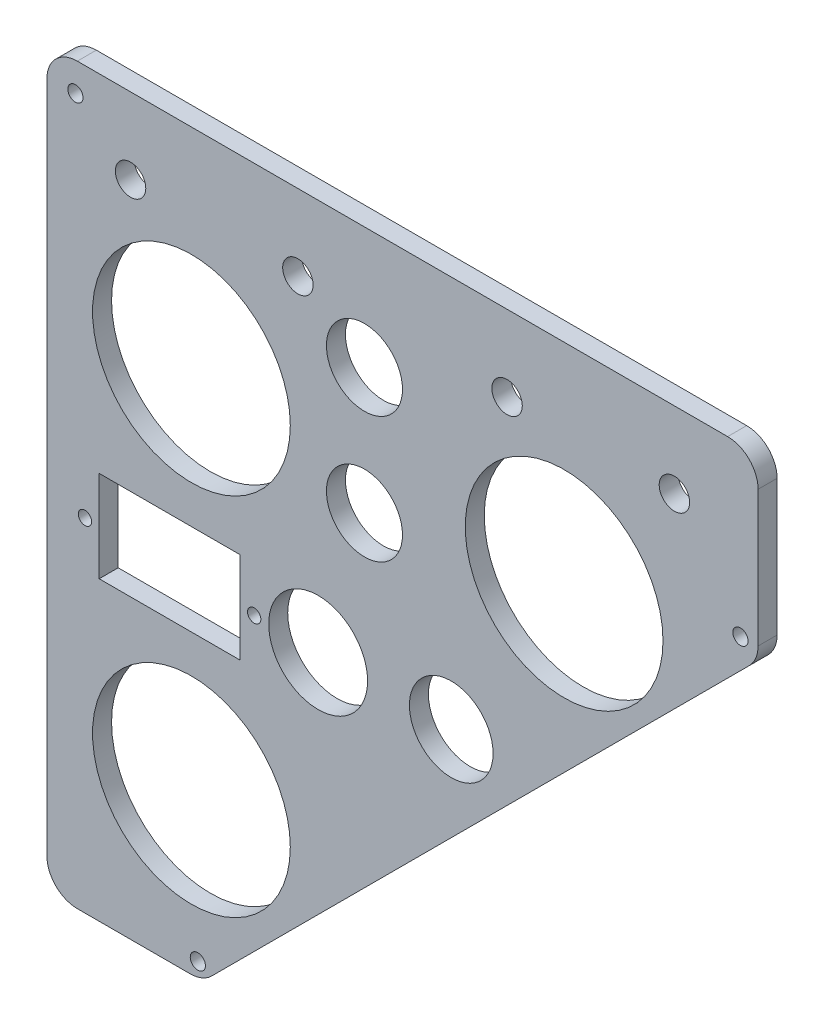
ISO-10303-21;
HEADER;
FILE_DESCRIPTION(('STEP AP214'),'2;1');
FILE_NAME('part.step','',(''),(''),'','','');
FILE_SCHEMA(('AUTOMOTIVE_DESIGN { 1 0 10303 214 1 1 1 1 }'));
ENDSEC;
DATA;
#1=APPLICATION_CONTEXT('core data for automotive mechanical design processes');
#2=APPLICATION_PROTOCOL_DEFINITION('international standard','automotive_design',2000,#1);
#3=PRODUCT_CONTEXT('',#1,'mechanical');
#4=PRODUCT('Part','Part','',(#3));
#5=PRODUCT_RELATED_PRODUCT_CATEGORY('part','',(#4));
#6=PRODUCT_DEFINITION_FORMATION('','',#4);
#7=PRODUCT_DEFINITION_CONTEXT('part definition',#1,'design');
#8=PRODUCT_DEFINITION('design','',#6,#7);
#9=PRODUCT_DEFINITION_SHAPE('','',#8);
#10=(LENGTH_UNIT() NAMED_UNIT(*) SI_UNIT(.MILLI.,.METRE.));
#11=(NAMED_UNIT(*) PLANE_ANGLE_UNIT() SI_UNIT($,.RADIAN.));
#12=(NAMED_UNIT(*) SI_UNIT($,.STERADIAN.) SOLID_ANGLE_UNIT());
#13=UNCERTAINTY_MEASURE_WITH_UNIT(LENGTH_MEASURE(1.E-05),#10,'distance_accuracy_value','');
#14=(GEOMETRIC_REPRESENTATION_CONTEXT(3) GLOBAL_UNCERTAINTY_ASSIGNED_CONTEXT((#13)) GLOBAL_UNIT_ASSIGNED_CONTEXT((#10,
#11,#12)) REPRESENTATION_CONTEXT('',''));
#15=CARTESIAN_POINT('',(0.,0.,0.));
#16=DIRECTION('',(0.,0.,1.));
#17=DIRECTION('',(1.,0.,0.));
#18=AXIS2_PLACEMENT_3D('',#15,#16,#17);
#19=CARTESIAN_POINT('',(8.,185.,5.));
#20=DIRECTION('',(0.,0.,-1.));
#21=DIRECTION('',(-1.,0.,0.));
#22=AXIS2_PLACEMENT_3D('',#19,#20,#21);
#23=CYLINDRICAL_SURFACE('',#22,8.);
#24=CARTESIAN_POINT('',(8.,185.,0.));
#25=DIRECTION('',(0.,0.,1.));
#26=DIRECTION('',(-1.,0.,0.));
#27=AXIS2_PLACEMENT_3D('',#24,#25,#26);
#28=CIRCLE('',#27,8.);
#29=CARTESIAN_POINT('',(8.,193.,0.));
#30=VERTEX_POINT('',#29);
#31=CARTESIAN_POINT('',(0.,185.,0.));
#32=VERTEX_POINT('',#31);
#33=EDGE_CURVE('E189',#30,#32,#28,.T.);
#34=ORIENTED_EDGE('',*,*,#33,.T.);
#35=DIRECTION('',(0.,0.,-1.));
#36=VECTOR('',#35,1.);
#37=CARTESIAN_POINT('',(0.,185.,5.));
#38=LINE('',#37,#36);
#39=CARTESIAN_POINT('',(0.,185.,5.));
#40=VERTEX_POINT('',#39);
#41=EDGE_CURVE('E236',#40,#32,#38,.T.);
#42=ORIENTED_EDGE('',*,*,#41,.F.);
#43=CARTESIAN_POINT('',(8.,185.,5.));
#44=DIRECTION('',(0.,0.,1.));
#45=DIRECTION('',(-1.,0.,0.));
#46=AXIS2_PLACEMENT_3D('',#43,#44,#45);
#47=CIRCLE('',#46,8.);
#48=CARTESIAN_POINT('',(8.,193.,5.));
#49=VERTEX_POINT('',#48);
#50=EDGE_CURVE('E166',#49,#40,#47,.T.);
#51=ORIENTED_EDGE('',*,*,#50,.F.);
#52=DIRECTION('',(0.,0.,-1.));
#53=VECTOR('',#52,1.);
#54=CARTESIAN_POINT('',(8.,193.,5.));
#55=LINE('',#54,#53);
#56=EDGE_CURVE('E188',#49,#30,#55,.T.);
#57=ORIENTED_EDGE('',*,*,#56,.T.);
#58=EDGE_LOOP('',(#34,#42,#51,#57));
#59=FACE_BOUND('',#58,.T.);
#60=ADVANCED_FACE('F36',(#59),#23,.T.);
#61=CARTESIAN_POINT('',(0.,8.,5.));
#62=DIRECTION('',(1.,0.,0.));
#63=DIRECTION('',(0.,1.,0.));
#64=AXIS2_PLACEMENT_3D('',#61,#62,#63);
#65=PLANE('',#64);
#66=DIRECTION('',(0.,-1.,0.));
#67=VECTOR('',#66,1.);
#68=CARTESIAN_POINT('',(0.,8.,0.));
#69=LINE('',#68,#67);
#70=CARTESIAN_POINT('',(0.,8.,0.));
#71=VERTEX_POINT('',#70);
#72=EDGE_CURVE('E192',#32,#71,#69,.T.);
#73=ORIENTED_EDGE('',*,*,#72,.T.);
#74=DIRECTION('',(0.,0.,-1.));
#75=VECTOR('',#74,1.);
#76=CARTESIAN_POINT('',(0.,8.,5.));
#77=LINE('',#76,#75);
#78=CARTESIAN_POINT('',(0.,8.,5.));
#79=VERTEX_POINT('',#78);
#80=EDGE_CURVE('E233',#79,#71,#77,.T.);
#81=ORIENTED_EDGE('',*,*,#80,.F.);
#82=DIRECTION('',(0.,-1.,0.));
#83=VECTOR('',#82,1.);
#84=CARTESIAN_POINT('',(0.,8.,5.));
#85=LINE('',#84,#83);
#86=EDGE_CURVE('E169',#40,#79,#85,.T.);
#87=ORIENTED_EDGE('',*,*,#86,.F.);
#88=ORIENTED_EDGE('',*,*,#41,.T.);
#89=EDGE_LOOP('',(#73,#81,#87,#88));
#90=FACE_BOUND('',#89,.T.);
#91=ADVANCED_FACE('F374',(#90),#65,.F.);
#92=CARTESIAN_POINT('',(8.,8.,5.));
#93=DIRECTION('',(0.,0.,-1.));
#94=DIRECTION('',(-1.,0.,0.));
#95=AXIS2_PLACEMENT_3D('',#92,#93,#94);
#96=CYLINDRICAL_SURFACE('',#95,8.);
#97=CARTESIAN_POINT('',(8.,8.,0.));
#98=DIRECTION('',(0.,0.,1.));
#99=DIRECTION('',(1.,0.,0.));
#100=AXIS2_PLACEMENT_3D('',#97,#98,#99);
#101=CIRCLE('',#100,8.);
#102=CARTESIAN_POINT('',(8.,0.,0.));
#103=VERTEX_POINT('',#102);
#104=EDGE_CURVE('E195',#71,#103,#101,.T.);
#105=ORIENTED_EDGE('',*,*,#104,.T.);
#106=DIRECTION('',(0.,0.,-1.));
#107=VECTOR('',#106,1.);
#108=CARTESIAN_POINT('',(8.,0.,5.));
#109=LINE('',#108,#107);
#110=CARTESIAN_POINT('',(8.,0.,5.));
#111=VERTEX_POINT('',#110);
#112=EDGE_CURVE('E230',#111,#103,#109,.T.);
#113=ORIENTED_EDGE('',*,*,#112,.F.);
#114=CARTESIAN_POINT('',(8.,8.,5.));
#115=DIRECTION('',(0.,0.,1.));
#116=DIRECTION('',(1.,0.,0.));
#117=AXIS2_PLACEMENT_3D('',#114,#115,#116);
#118=CIRCLE('',#117,8.);
#119=EDGE_CURVE('E172',#79,#111,#118,.T.);
#120=ORIENTED_EDGE('',*,*,#119,.F.);
#121=ORIENTED_EDGE('',*,*,#80,.T.);
#122=EDGE_LOOP('',(#105,#113,#120,#121));
#123=FACE_BOUND('',#122,.T.);
#124=ADVANCED_FACE('F379',(#123),#96,.T.);
#125=CARTESIAN_POINT('',(37.6862915010168,0.,5.));
#126=DIRECTION('',(0.,1.,0.));
#127=DIRECTION('',(-1.,0.,0.));
#128=AXIS2_PLACEMENT_3D('',#125,#126,#127);
#129=PLANE('',#128);
#130=DIRECTION('',(1.,0.,0.));
#131=VECTOR('',#130,1.);
#132=CARTESIAN_POINT('',(37.6862915010168,0.,0.));
#133=LINE('',#132,#131);
#134=CARTESIAN_POINT('',(37.6862915010168,0.,0.));
#135=VERTEX_POINT('',#134);
#136=EDGE_CURVE('E197',#103,#135,#133,.T.);
#137=ORIENTED_EDGE('',*,*,#136,.T.);
#138=DIRECTION('',(0.,0.,-1.));
#139=VECTOR('',#138,1.);
#140=CARTESIAN_POINT('',(37.6862915010168,0.,5.));
#141=LINE('',#140,#139);
#142=CARTESIAN_POINT('',(37.6862915010168,0.,5.));
#143=VERTEX_POINT('',#142);
#144=EDGE_CURVE('E227',#143,#135,#141,.T.);
#145=ORIENTED_EDGE('',*,*,#144,.F.);
#146=DIRECTION('',(1.,0.,0.));
#147=VECTOR('',#146,1.);
#148=CARTESIAN_POINT('',(37.6862915010168,0.,5.));
#149=LINE('',#148,#147);
#150=EDGE_CURVE('E174',#111,#143,#149,.T.);
#151=ORIENTED_EDGE('',*,*,#150,.F.);
#152=ORIENTED_EDGE('',*,*,#112,.T.);
#153=EDGE_LOOP('',(#137,#145,#151,#152));
#154=FACE_BOUND('',#153,.T.);
#155=ADVANCED_FACE('F421',(#154),#129,.F.);
#156=CARTESIAN_POINT('',(37.6862915010168,8.00000000000001,5.));
#157=DIRECTION('',(0.,0.,-1.));
#158=DIRECTION('',(-1.,0.,0.));
#159=AXIS2_PLACEMENT_3D('',#156,#157,#158);
#160=CYLINDRICAL_SURFACE('',#159,8.);
#161=CARTESIAN_POINT('',(37.6862915010168,8.00000000000001,0.));
#162=DIRECTION('',(0.,0.,1.));
#163=DIRECTION('',(-1.,0.,0.));
#164=AXIS2_PLACEMENT_3D('',#161,#162,#163);
#165=CIRCLE('',#164,8.);
#166=CARTESIAN_POINT('',(43.3431457505092,2.34314575050765,0.));
#167=VERTEX_POINT('',#166);
#168=EDGE_CURVE('E199',#135,#167,#165,.T.);
#169=ORIENTED_EDGE('',*,*,#168,.T.);
#170=DIRECTION('',(0.,0.,-1.));
#171=VECTOR('',#170,1.);
#172=CARTESIAN_POINT('',(43.3431457505092,2.34314575050765,5.));
#173=LINE('',#172,#171);
#174=CARTESIAN_POINT('',(43.3431457505092,2.34314575050765,5.));
#175=VERTEX_POINT('',#174);
#176=EDGE_CURVE('E224',#175,#167,#173,.T.);
#177=ORIENTED_EDGE('',*,*,#176,.F.);
#178=CARTESIAN_POINT('',(37.6862915010168,8.00000000000001,5.));
#179=DIRECTION('',(0.,0.,1.));
#180=DIRECTION('',(-1.,0.,0.));
#181=AXIS2_PLACEMENT_3D('',#178,#179,#180);
#182=CIRCLE('',#181,8.);
#183=EDGE_CURVE('E176',#143,#175,#182,.T.);
#184=ORIENTED_EDGE('',*,*,#183,.F.);
#185=ORIENTED_EDGE('',*,*,#144,.T.);
#186=EDGE_LOOP('',(#169,#177,#184,#185));
#187=FACE_BOUND('',#186,.T.);
#188=ADVANCED_FACE('F416',(#187),#160,.T.);
#189=CARTESIAN_POINT('',(184.656854249492,143.656854249492,5.));
#190=DIRECTION('',(-0.707106781186552,0.707106781186544,0.));
#191=DIRECTION('',(-0.707106781186544,-0.707106781186552,0.));
#192=AXIS2_PLACEMENT_3D('',#189,#190,#191);
#193=PLANE('',#192);
#194=DIRECTION('',(0.707106781186543,0.707106781186551,0.));
#195=VECTOR('',#194,1.);
#196=CARTESIAN_POINT('',(184.656854249492,143.656854249492,0.));
#197=LINE('',#196,#195);
#198=CARTESIAN_POINT('',(184.656854249492,143.656854249492,0.));
#199=VERTEX_POINT('',#198);
#200=EDGE_CURVE('E201',#167,#199,#197,.T.);
#201=ORIENTED_EDGE('',*,*,#200,.T.);
#202=DIRECTION('',(0.,0.,-1.));
#203=VECTOR('',#202,1.);
#204=CARTESIAN_POINT('',(184.656854249492,143.656854249492,5.));
#205=LINE('',#204,#203);
#206=CARTESIAN_POINT('',(184.656854249492,143.656854249492,5.));
#207=VERTEX_POINT('',#206);
#208=EDGE_CURVE('E221',#207,#199,#205,.T.);
#209=ORIENTED_EDGE('',*,*,#208,.F.);
#210=DIRECTION('',(0.707106781186543,0.707106781186551,0.));
#211=VECTOR('',#210,1.);
#212=CARTESIAN_POINT('',(184.656854249492,143.656854249492,5.));
#213=LINE('',#212,#211);
#214=EDGE_CURVE('E178',#175,#207,#213,.T.);
#215=ORIENTED_EDGE('',*,*,#214,.F.);
#216=ORIENTED_EDGE('',*,*,#176,.T.);
#217=EDGE_LOOP('',(#201,#209,#215,#216));
#218=FACE_BOUND('',#217,.T.);
#219=ADVANCED_FACE('F412',(#218),#193,.F.);
#220=CARTESIAN_POINT('',(179.,149.313708498985,5.));
#221=DIRECTION('',(0.,0.,-1.));
#222=DIRECTION('',(-1.,0.,0.));
#223=AXIS2_PLACEMENT_3D('',#220,#221,#222);
#224=CYLINDRICAL_SURFACE('',#223,7.99999999999998);
#225=CARTESIAN_POINT('',(179.,149.313708498985,0.));
#226=DIRECTION('',(0.,0.,1.));
#227=DIRECTION('',(-1.,0.,0.));
#228=AXIS2_PLACEMENT_3D('',#225,#226,#227);
#229=CIRCLE('',#228,7.99999999999998);
#230=CARTESIAN_POINT('',(187.,149.313708498985,0.));
#231=VERTEX_POINT('',#230);
#232=EDGE_CURVE('E203',#199,#231,#229,.T.);
#233=ORIENTED_EDGE('',*,*,#232,.T.);
#234=DIRECTION('',(0.,0.,-1.));
#235=VECTOR('',#234,1.);
#236=CARTESIAN_POINT('',(187.,149.313708498985,5.));
#237=LINE('',#236,#235);
#238=CARTESIAN_POINT('',(187.,149.313708498985,5.));
#239=VERTEX_POINT('',#238);
#240=EDGE_CURVE('E218',#239,#231,#237,.T.);
#241=ORIENTED_EDGE('',*,*,#240,.F.);
#242=CARTESIAN_POINT('',(179.,149.313708498985,5.));
#243=DIRECTION('',(0.,0.,1.));
#244=DIRECTION('',(-1.,0.,0.));
#245=AXIS2_PLACEMENT_3D('',#242,#243,#244);
#246=CIRCLE('',#245,7.99999999999998);
#247=EDGE_CURVE('E180',#207,#239,#246,.T.);
#248=ORIENTED_EDGE('',*,*,#247,.F.);
#249=ORIENTED_EDGE('',*,*,#208,.T.);
#250=EDGE_LOOP('',(#233,#241,#248,#249));
#251=FACE_BOUND('',#250,.T.);
#252=ADVANCED_FACE('F408',(#251),#224,.T.);
#253=CARTESIAN_POINT('',(187.,185.,5.));
#254=DIRECTION('',(-1.,0.,0.));
#255=DIRECTION('',(0.,0.,1.));
#256=AXIS2_PLACEMENT_3D('',#253,#254,#255);
#257=PLANE('',#256);
#258=DIRECTION('',(0.,1.,0.));
#259=VECTOR('',#258,1.);
#260=CARTESIAN_POINT('',(187.,185.,0.));
#261=LINE('',#260,#259);
#262=CARTESIAN_POINT('',(187.,185.,0.));
#263=VERTEX_POINT('',#262);
#264=EDGE_CURVE('E205',#231,#263,#261,.T.);
#265=ORIENTED_EDGE('',*,*,#264,.T.);
#266=DIRECTION('',(0.,0.,-1.));
#267=VECTOR('',#266,1.);
#268=CARTESIAN_POINT('',(187.,185.,5.));
#269=LINE('',#268,#267);
#270=CARTESIAN_POINT('',(187.,185.,5.));
#271=VERTEX_POINT('',#270);
#272=EDGE_CURVE('E215',#271,#263,#269,.T.);
#273=ORIENTED_EDGE('',*,*,#272,.F.);
#274=DIRECTION('',(0.,1.,0.));
#275=VECTOR('',#274,1.);
#276=CARTESIAN_POINT('',(187.,185.,5.));
#277=LINE('',#276,#275);
#278=EDGE_CURVE('E182',#239,#271,#277,.T.);
#279=ORIENTED_EDGE('',*,*,#278,.F.);
#280=ORIENTED_EDGE('',*,*,#240,.T.);
#281=EDGE_LOOP('',(#265,#273,#279,#280));
#282=FACE_BOUND('',#281,.T.);
#283=ADVANCED_FACE('F403',(#282),#257,.F.);
#284=CARTESIAN_POINT('',(179.,185.,5.));
#285=DIRECTION('',(0.,0.,-1.));
#286=DIRECTION('',(-1.,0.,0.));
#287=AXIS2_PLACEMENT_3D('',#284,#285,#286);
#288=CYLINDRICAL_SURFACE('',#287,8.00000000000001);
#289=CARTESIAN_POINT('',(179.,185.,0.));
#290=DIRECTION('',(0.,0.,1.));
#291=DIRECTION('',(-1.,0.,0.));
#292=AXIS2_PLACEMENT_3D('',#289,#290,#291);
#293=CIRCLE('',#292,8.00000000000001);
#294=CARTESIAN_POINT('',(179.,193.,0.));
#295=VERTEX_POINT('',#294);
#296=EDGE_CURVE('E207',#263,#295,#293,.T.);
#297=ORIENTED_EDGE('',*,*,#296,.T.);
#298=DIRECTION('',(0.,0.,-1.));
#299=VECTOR('',#298,1.);
#300=CARTESIAN_POINT('',(179.,193.,5.));
#301=LINE('',#300,#299);
#302=CARTESIAN_POINT('',(179.,193.,5.));
#303=VERTEX_POINT('',#302);
#304=EDGE_CURVE('E212',#303,#295,#301,.T.);
#305=ORIENTED_EDGE('',*,*,#304,.F.);
#306=CARTESIAN_POINT('',(179.,185.,5.));
#307=DIRECTION('',(0.,0.,1.));
#308=DIRECTION('',(-1.,0.,0.));
#309=AXIS2_PLACEMENT_3D('',#306,#307,#308);
#310=CIRCLE('',#309,8.00000000000001);
#311=EDGE_CURVE('E184',#271,#303,#310,.T.);
#312=ORIENTED_EDGE('',*,*,#311,.F.);
#313=ORIENTED_EDGE('',*,*,#272,.T.);
#314=EDGE_LOOP('',(#297,#305,#312,#313));
#315=FACE_BOUND('',#314,.T.);
#316=ADVANCED_FACE('F397',(#315),#288,.T.);
#317=CARTESIAN_POINT('',(8.,193.,5.));
#318=DIRECTION('',(0.,-1.,0.));
#319=DIRECTION('',(0.,0.,-1.));
#320=AXIS2_PLACEMENT_3D('',#317,#318,#319);
#321=PLANE('',#320);
#322=DIRECTION('',(-1.,0.,0.));
#323=VECTOR('',#322,1.);
#324=CARTESIAN_POINT('',(8.,193.,0.));
#325=LINE('',#324,#323);
#326=EDGE_CURVE('E170',#295,#30,#325,.T.);
#327=ORIENTED_EDGE('',*,*,#326,.T.);
#328=ORIENTED_EDGE('',*,*,#56,.F.);
#329=DIRECTION('',(-1.,0.,0.));
#330=VECTOR('',#329,1.);
#331=CARTESIAN_POINT('',(8.,193.,5.));
#332=LINE('',#331,#330);
#333=EDGE_CURVE('E186',#303,#49,#332,.T.);
#334=ORIENTED_EDGE('',*,*,#333,.F.);
#335=ORIENTED_EDGE('',*,*,#304,.T.);
#336=EDGE_LOOP('',(#327,#328,#334,#335));
#337=FACE_BOUND('',#336,.T.);
#338=ADVANCED_FACE('F347',(#337),#321,.F.);
#339=CARTESIAN_POINT('',(8.,185.,5.));
#340=DIRECTION('',(0.,0.,-1.));
#341=DIRECTION('',(-1.,0.,0.));
#342=AXIS2_PLACEMENT_3D('',#339,#340,#341);
#343=PLANE('',#342);
#344=CARTESIAN_POINT('',(182.36,149.12,5.));
#345=DIRECTION('',(0.,0.,-1.));
#346=DIRECTION('',(-1.,0.,0.));
#347=AXIS2_PLACEMENT_3D('',#344,#345,#346);
#348=CIRCLE('',#347,2.);
#349=CARTESIAN_POINT('',(180.36,149.12,5.));
#350=VERTEX_POINT('',#349);
#351=EDGE_CURVE('E39',#350,#350,#348,.T.);
#352=ORIENTED_EDGE('',*,*,#351,.T.);
#353=EDGE_LOOP('',(#352));
#354=FACE_BOUND('',#353,.T.);
#355=CARTESIAN_POINT('',(7.49999999999996,185.4,5.));
#356=DIRECTION('',(0.,0.,-1.));
#357=DIRECTION('',(-1.,0.,0.));
#358=AXIS2_PLACEMENT_3D('',#355,#356,#357);
#359=CIRCLE('',#358,1.99999999999999);
#360=CARTESIAN_POINT('',(5.49999999999996,185.4,5.));
#361=VERTEX_POINT('',#360);
#362=EDGE_CURVE('E286',#361,#361,#359,.T.);
#363=ORIENTED_EDGE('',*,*,#362,.T.);
#364=EDGE_LOOP('',(#363));
#365=FACE_BOUND('',#364,.T.);
#366=CARTESIAN_POINT('',(39.6899999999999,3.83000000000003,5.));
#367=DIRECTION('',(0.,0.,-1.));
#368=DIRECTION('',(-1.,0.,0.));
#369=AXIS2_PLACEMENT_3D('',#366,#367,#368);
#370=CIRCLE('',#369,1.99999999999999);
#371=CARTESIAN_POINT('',(37.6899999999999,3.83000000000003,5.));
#372=VERTEX_POINT('',#371);
#373=EDGE_CURVE('E282',#372,#372,#370,.T.);
#374=ORIENTED_EDGE('',*,*,#373,.T.);
#375=EDGE_LOOP('',(#374));
#376=FACE_BOUND('',#375,.T.);
#377=CARTESIAN_POINT('',(22.,173.,5.));
#378=DIRECTION('',(0.,0.,1.));
#379=DIRECTION('',(1.,0.,0.));
#380=AXIS2_PLACEMENT_3D('',#377,#378,#379);
#381=CIRCLE('',#380,4.);
#382=CARTESIAN_POINT('',(26.,173.,5.));
#383=VERTEX_POINT('',#382);
#384=EDGE_CURVE('E272',#383,#383,#381,.T.);
#385=ORIENTED_EDGE('',*,*,#384,.F.);
#386=EDGE_LOOP('',(#385));
#387=FACE_BOUND('',#386,.T.);
#388=CARTESIAN_POINT('',(66.,173.,5.));
#389=DIRECTION('',(0.,0.,1.));
#390=DIRECTION('',(1.,0.,0.));
#391=AXIS2_PLACEMENT_3D('',#388,#389,#390);
#392=CIRCLE('',#391,4.00000000000002);
#393=CARTESIAN_POINT('',(70.,173.,5.));
#394=VERTEX_POINT('',#393);
#395=EDGE_CURVE('E307',#394,#394,#392,.T.);
#396=ORIENTED_EDGE('',*,*,#395,.F.);
#397=EDGE_LOOP('',(#396));
#398=FACE_BOUND('',#397,.T.);
#399=CARTESIAN_POINT('',(121.,173.,5.));
#400=DIRECTION('',(0.,0.,1.));
#401=DIRECTION('',(1.,0.,0.));
#402=AXIS2_PLACEMENT_3D('',#399,#400,#401);
#403=CIRCLE('',#402,4.00000000000001);
#404=CARTESIAN_POINT('',(125.,173.,5.));
#405=VERTEX_POINT('',#404);
#406=EDGE_CURVE('E310',#405,#405,#403,.T.);
#407=ORIENTED_EDGE('',*,*,#406,.F.);
#408=EDGE_LOOP('',(#407));
#409=FACE_BOUND('',#408,.T.);
#410=CARTESIAN_POINT('',(165.,173.,5.));
#411=DIRECTION('',(0.,0.,1.));
#412=DIRECTION('',(1.,0.,0.));
#413=AXIS2_PLACEMENT_3D('',#410,#411,#412);
#414=CIRCLE('',#413,3.99999999999999);
#415=CARTESIAN_POINT('',(169.,173.,5.));
#416=VERTEX_POINT('',#415);
#417=EDGE_CURVE('E284',#416,#416,#414,.T.);
#418=ORIENTED_EDGE('',*,*,#417,.F.);
#419=EDGE_LOOP('',(#418));
#420=FACE_BOUND('',#419,.T.);
#421=CARTESIAN_POINT('',(136.,138.,5.));
#422=DIRECTION('',(0.,0.,1.));
#423=DIRECTION('',(1.,0.,0.));
#424=AXIS2_PLACEMENT_3D('',#421,#422,#423);
#425=CIRCLE('',#424,26.);
#426=CARTESIAN_POINT('',(162.,138.,5.));
#427=VERTEX_POINT('',#426);
#428=EDGE_CURVE('E324',#427,#427,#425,.T.);
#429=ORIENTED_EDGE('',*,*,#428,.F.);
#430=EDGE_LOOP('',(#429));
#431=FACE_BOUND('',#430,.T.);
#432=CARTESIAN_POINT('',(71.3195099864327,90.,5.));
#433=DIRECTION('',(0.,0.,1.));
#434=DIRECTION('',(1.,0.,0.));
#435=AXIS2_PLACEMENT_3D('',#432,#433,#434);
#436=CIRCLE('',#435,13.);
#437=CARTESIAN_POINT('',(84.3195099864327,90.,5.));
#438=VERTEX_POINT('',#437);
#439=EDGE_CURVE('E321',#438,#438,#436,.T.);
#440=ORIENTED_EDGE('',*,*,#439,.F.);
#441=EDGE_LOOP('',(#440));
#442=FACE_BOUND('',#441,.T.);
#443=CARTESIAN_POINT('',(38.,42.,5.));
#444=DIRECTION('',(0.,0.,1.));
#445=DIRECTION('',(1.,0.,0.));
#446=AXIS2_PLACEMENT_3D('',#443,#444,#445);
#447=CIRCLE('',#446,26.);
#448=CARTESIAN_POINT('',(64.,42.,5.));
#449=VERTEX_POINT('',#448);
#450=EDGE_CURVE('E318',#449,#449,#447,.T.);
#451=ORIENTED_EDGE('',*,*,#450,.F.);
#452=EDGE_LOOP('',(#451));
#453=FACE_BOUND('',#452,.T.);
#454=CARTESIAN_POINT('',(38.,138.,5.));
#455=DIRECTION('',(0.,0.,1.));
#456=DIRECTION('',(1.,0.,0.));
#457=AXIS2_PLACEMENT_3D('',#454,#455,#456);
#458=CIRCLE('',#457,26.);
#459=CARTESIAN_POINT('',(64.,138.,5.));
#460=VERTEX_POINT('',#459);
#461=EDGE_CURVE('E317',#460,#460,#458,.T.);
#462=ORIENTED_EDGE('',*,*,#461,.F.);
#463=EDGE_LOOP('',(#462));
#464=FACE_BOUND('',#463,.T.);
#465=CARTESIAN_POINT('',(106.319509986433,90.,5.));
#466=DIRECTION('',(0.,0.,1.));
#467=DIRECTION('',(1.,0.,0.));
#468=AXIS2_PLACEMENT_3D('',#465,#466,#467);
#469=CIRCLE('',#468,11.);
#470=CARTESIAN_POINT('',(117.319509986433,90.,5.));
#471=VERTEX_POINT('',#470);
#472=EDGE_CURVE('E327',#471,#471,#469,.T.);
#473=ORIENTED_EDGE('',*,*,#472,.F.);
#474=EDGE_LOOP('',(#473));
#475=FACE_BOUND('',#474,.T.);
#476=CARTESIAN_POINT('',(83.5,161.,5.));
#477=DIRECTION('',(0.,0.,1.));
#478=DIRECTION('',(1.,0.,0.));
#479=AXIS2_PLACEMENT_3D('',#476,#477,#478);
#480=CIRCLE('',#479,9.99999999999747);
#481=CARTESIAN_POINT('',(93.4999999999975,161.,5.));
#482=VERTEX_POINT('',#481);
#483=EDGE_CURVE('E336',#482,#482,#480,.T.);
#484=ORIENTED_EDGE('',*,*,#483,.F.);
#485=EDGE_LOOP('',(#484));
#486=FACE_BOUND('',#485,.T.);
#487=CARTESIAN_POINT('',(54.5,90.,5.));
#488=DIRECTION('',(0.,0.,1.));
#489=DIRECTION('',(1.,0.,0.));
#490=AXIS2_PLACEMENT_3D('',#487,#488,#489);
#491=CIRCLE('',#490,1.75000000000001);
#492=CARTESIAN_POINT('',(56.25,90.,5.));
#493=VERTEX_POINT('',#492);
#494=EDGE_CURVE('E333',#493,#493,#491,.T.);
#495=ORIENTED_EDGE('',*,*,#494,.F.);
#496=EDGE_LOOP('',(#495));
#497=FACE_BOUND('',#496,.T.);
#498=CARTESIAN_POINT('',(10.,90.,5.));
#499=DIRECTION('',(0.,0.,1.));
#500=DIRECTION('',(1.,0.,0.));
#501=AXIS2_PLACEMENT_3D('',#498,#499,#500);
#502=CIRCLE('',#501,1.75000000000001);
#503=CARTESIAN_POINT('',(11.75,90.,5.));
#504=VERTEX_POINT('',#503);
#505=EDGE_CURVE('E330',#504,#504,#502,.T.);
#506=ORIENTED_EDGE('',*,*,#505,.F.);
#507=EDGE_LOOP('',(#506));
#508=FACE_BOUND('',#507,.T.);
#509=CARTESIAN_POINT('',(83.5,127.850051572618,5.));
#510=DIRECTION('',(0.,0.,1.));
#511=DIRECTION('',(1.,0.,0.));
#512=AXIS2_PLACEMENT_3D('',#509,#510,#511);
#513=CIRCLE('',#512,9.99999999999831);
#514=CARTESIAN_POINT('',(93.4999999999984,127.850051572618,5.));
#515=VERTEX_POINT('',#514);
#516=EDGE_CURVE('E281',#515,#515,#513,.T.);
#517=ORIENTED_EDGE('',*,*,#516,.F.);
#518=EDGE_LOOP('',(#517));
#519=FACE_BOUND('',#518,.T.);
#520=DIRECTION('',(0.,1.,0.));
#521=VECTOR('',#520,1.);
#522=CARTESIAN_POINT('',(50.75,102.,5.));
#523=LINE('',#522,#521);
#524=CARTESIAN_POINT('',(50.75,78.,5.));
#525=VERTEX_POINT('',#524);
#526=CARTESIAN_POINT('',(50.75,102.,5.));
#527=VERTEX_POINT('',#526);
#528=EDGE_CURVE('E149',#525,#527,#523,.T.);
#529=ORIENTED_EDGE('',*,*,#528,.F.);
#530=DIRECTION('',(1.,0.,0.));
#531=VECTOR('',#530,1.);
#532=CARTESIAN_POINT('',(50.75,78.,5.));
#533=LINE('',#532,#531);
#534=CARTESIAN_POINT('',(13.75,78.,5.));
#535=VERTEX_POINT('',#534);
#536=EDGE_CURVE('E52',#535,#525,#533,.T.);
#537=ORIENTED_EDGE('',*,*,#536,.F.);
#538=DIRECTION('',(0.,-1.,0.));
#539=VECTOR('',#538,1.);
#540=CARTESIAN_POINT('',(13.75,78.,5.));
#541=LINE('',#540,#539);
#542=CARTESIAN_POINT('',(13.75,102.,5.));
#543=VERTEX_POINT('',#542);
#544=EDGE_CURVE('E156',#543,#535,#541,.T.);
#545=ORIENTED_EDGE('',*,*,#544,.F.);
#546=DIRECTION('',(-1.,0.,0.));
#547=VECTOR('',#546,1.);
#548=CARTESIAN_POINT('',(13.75,102.,5.));
#549=LINE('',#548,#547);
#550=EDGE_CURVE('E140',#527,#543,#549,.T.);
#551=ORIENTED_EDGE('',*,*,#550,.F.);
#552=EDGE_LOOP('',(#529,#537,#545,#551));
#553=FACE_BOUND('',#552,.T.);
#554=ORIENTED_EDGE('',*,*,#50,.T.);
#555=ORIENTED_EDGE('',*,*,#86,.T.);
#556=ORIENTED_EDGE('',*,*,#119,.T.);
#557=ORIENTED_EDGE('',*,*,#150,.T.);
#558=ORIENTED_EDGE('',*,*,#183,.T.);
#559=ORIENTED_EDGE('',*,*,#214,.T.);
#560=ORIENTED_EDGE('',*,*,#247,.T.);
#561=ORIENTED_EDGE('',*,*,#278,.T.);
#562=ORIENTED_EDGE('',*,*,#311,.T.);
#563=ORIENTED_EDGE('',*,*,#333,.T.);
#564=EDGE_LOOP('',(#554,#555,#556,#557,#558,#559,#560,#561,#562,#563));
#565=FACE_BOUND('',#564,.T.);
#566=ADVANCED_FACE('F153',(#354,#365,#376,#387,#398,#409,#420,#431,#442,#453,#464,#475,#486,
#497,#508,#519,#553,#565),#343,.F.);
#567=CARTESIAN_POINT('',(8.,185.,0.));
#568=DIRECTION('',(0.,0.,-1.));
#569=DIRECTION('',(-1.,0.,0.));
#570=AXIS2_PLACEMENT_3D('',#567,#568,#569);
#571=PLANE('',#570);
#572=CARTESIAN_POINT('',(182.36,149.12,0.));
#573=DIRECTION('',(0.,0.,-1.));
#574=DIRECTION('',(-1.,0.,0.));
#575=AXIS2_PLACEMENT_3D('',#572,#573,#574);
#576=CIRCLE('',#575,2.025);
#577=CARTESIAN_POINT('',(180.335,149.12,0.));
#578=VERTEX_POINT('',#577);
#579=EDGE_CURVE('E756',#578,#578,#576,.T.);
#580=ORIENTED_EDGE('',*,*,#579,.F.);
#581=EDGE_LOOP('',(#580));
#582=FACE_BOUND('',#581,.T.);
#583=CARTESIAN_POINT('',(7.49999999999996,185.4,0.));
#584=DIRECTION('',(0.,0.,-1.));
#585=DIRECTION('',(-1.,0.,0.));
#586=AXIS2_PLACEMENT_3D('',#583,#584,#585);
#587=CIRCLE('',#586,2.025);
#588=CARTESIAN_POINT('',(5.47499999999996,185.4,0.));
#589=VERTEX_POINT('',#588);
#590=EDGE_CURVE('E295',#589,#589,#587,.T.);
#591=ORIENTED_EDGE('',*,*,#590,.F.);
#592=EDGE_LOOP('',(#591));
#593=FACE_BOUND('',#592,.T.);
#594=CARTESIAN_POINT('',(39.6899999999999,3.83000000000003,0.));
#595=DIRECTION('',(0.,0.,-1.));
#596=DIRECTION('',(-1.,0.,0.));
#597=AXIS2_PLACEMENT_3D('',#594,#595,#596);
#598=CIRCLE('',#597,2.025);
#599=CARTESIAN_POINT('',(37.6649999999999,3.83000000000003,0.));
#600=VERTEX_POINT('',#599);
#601=EDGE_CURVE('E288',#600,#600,#598,.T.);
#602=ORIENTED_EDGE('',*,*,#601,.F.);
#603=EDGE_LOOP('',(#602));
#604=FACE_BOUND('',#603,.T.);
#605=CARTESIAN_POINT('',(22.,173.,0.));
#606=DIRECTION('',(0.,0.,-1.));
#607=DIRECTION('',(-1.,0.,0.));
#608=AXIS2_PLACEMENT_3D('',#605,#606,#607);
#609=CIRCLE('',#608,4.);
#610=CARTESIAN_POINT('',(18.,173.,0.));
#611=VERTEX_POINT('',#610);
#612=EDGE_CURVE('E278',#611,#611,#609,.T.);
#613=ORIENTED_EDGE('',*,*,#612,.F.);
#614=EDGE_LOOP('',(#613));
#615=FACE_BOUND('',#614,.T.);
#616=CARTESIAN_POINT('',(66.,173.,0.));
#617=DIRECTION('',(0.,0.,-1.));
#618=DIRECTION('',(-1.,0.,0.));
#619=AXIS2_PLACEMENT_3D('',#616,#617,#618);
#620=CIRCLE('',#619,4.00000000000002);
#621=CARTESIAN_POINT('',(62.,173.,0.));
#622=VERTEX_POINT('',#621);
#623=EDGE_CURVE('E275',#622,#622,#620,.T.);
#624=ORIENTED_EDGE('',*,*,#623,.F.);
#625=EDGE_LOOP('',(#624));
#626=FACE_BOUND('',#625,.T.);
#627=CARTESIAN_POINT('',(121.,173.,0.));
#628=DIRECTION('',(0.,0.,-1.));
#629=DIRECTION('',(-1.,0.,0.));
#630=AXIS2_PLACEMENT_3D('',#627,#628,#629);
#631=CIRCLE('',#630,4.00000000000001);
#632=CARTESIAN_POINT('',(117.,173.,0.));
#633=VERTEX_POINT('',#632);
#634=EDGE_CURVE('E271',#633,#633,#631,.T.);
#635=ORIENTED_EDGE('',*,*,#634,.F.);
#636=EDGE_LOOP('',(#635));
#637=FACE_BOUND('',#636,.T.);
#638=CARTESIAN_POINT('',(165.,173.,0.));
#639=DIRECTION('',(0.,0.,-1.));
#640=DIRECTION('',(-1.,0.,0.));
#641=AXIS2_PLACEMENT_3D('',#638,#639,#640);
#642=CIRCLE('',#641,3.99999999999999);
#643=CARTESIAN_POINT('',(161.,173.,0.));
#644=VERTEX_POINT('',#643);
#645=EDGE_CURVE('E268',#644,#644,#642,.T.);
#646=ORIENTED_EDGE('',*,*,#645,.F.);
#647=EDGE_LOOP('',(#646));
#648=FACE_BOUND('',#647,.T.);
#649=CARTESIAN_POINT('',(136.,138.,0.));
#650=DIRECTION('',(0.,0.,-1.));
#651=DIRECTION('',(-1.,0.,0.));
#652=AXIS2_PLACEMENT_3D('',#649,#650,#651);
#653=CIRCLE('',#652,26.);
#654=CARTESIAN_POINT('',(110.,138.,0.));
#655=VERTEX_POINT('',#654);
#656=EDGE_CURVE('E193',#655,#655,#653,.T.);
#657=ORIENTED_EDGE('',*,*,#656,.F.);
#658=EDGE_LOOP('',(#657));
#659=FACE_BOUND('',#658,.T.);
#660=CARTESIAN_POINT('',(71.3195099864327,90.,0.));
#661=DIRECTION('',(0.,0.,-1.));
#662=DIRECTION('',(-1.,0.,0.));
#663=AXIS2_PLACEMENT_3D('',#660,#661,#662);
#664=CIRCLE('',#663,13.);
#665=CARTESIAN_POINT('',(58.3195099864327,90.,0.));
#666=VERTEX_POINT('',#665);
#667=EDGE_CURVE('E263',#666,#666,#664,.T.);
#668=ORIENTED_EDGE('',*,*,#667,.F.);
#669=EDGE_LOOP('',(#668));
#670=FACE_BOUND('',#669,.T.);
#671=CARTESIAN_POINT('',(38.,42.,0.));
#672=DIRECTION('',(0.,0.,-1.));
#673=DIRECTION('',(-1.,0.,0.));
#674=AXIS2_PLACEMENT_3D('',#671,#672,#673);
#675=CIRCLE('',#674,26.);
#676=CARTESIAN_POINT('',(12.,42.,0.));
#677=VERTEX_POINT('',#676);
#678=EDGE_CURVE('E260',#677,#677,#675,.T.);
#679=ORIENTED_EDGE('',*,*,#678,.F.);
#680=EDGE_LOOP('',(#679));
#681=FACE_BOUND('',#680,.T.);
#682=CARTESIAN_POINT('',(38.,138.,0.));
#683=DIRECTION('',(0.,0.,-1.));
#684=DIRECTION('',(-1.,0.,0.));
#685=AXIS2_PLACEMENT_3D('',#682,#683,#684);
#686=CIRCLE('',#685,26.);
#687=CARTESIAN_POINT('',(12.,138.,0.));
#688=VERTEX_POINT('',#687);
#689=EDGE_CURVE('E257',#688,#688,#686,.T.);
#690=ORIENTED_EDGE('',*,*,#689,.F.);
#691=EDGE_LOOP('',(#690));
#692=FACE_BOUND('',#691,.T.);
#693=CARTESIAN_POINT('',(106.319509986433,90.,0.));
#694=DIRECTION('',(0.,0.,-1.));
#695=DIRECTION('',(-1.,0.,0.));
#696=AXIS2_PLACEMENT_3D('',#693,#694,#695);
#697=CIRCLE('',#696,11.);
#698=CARTESIAN_POINT('',(95.3195099864327,90.,0.));
#699=VERTEX_POINT('',#698);
#700=EDGE_CURVE('E254',#699,#699,#697,.T.);
#701=ORIENTED_EDGE('',*,*,#700,.F.);
#702=EDGE_LOOP('',(#701));
#703=FACE_BOUND('',#702,.T.);
#704=CARTESIAN_POINT('',(83.5,161.,0.));
#705=DIRECTION('',(0.,0.,-1.));
#706=DIRECTION('',(-1.,0.,0.));
#707=AXIS2_PLACEMENT_3D('',#704,#705,#706);
#708=CIRCLE('',#707,9.99999999999747);
#709=CARTESIAN_POINT('',(73.5000000000025,161.,0.));
#710=VERTEX_POINT('',#709);
#711=EDGE_CURVE('E251',#710,#710,#708,.T.);
#712=ORIENTED_EDGE('',*,*,#711,.F.);
#713=EDGE_LOOP('',(#712));
#714=FACE_BOUND('',#713,.T.);
#715=CARTESIAN_POINT('',(54.5,90.,0.));
#716=DIRECTION('',(0.,0.,-1.));
#717=DIRECTION('',(-1.,0.,0.));
#718=AXIS2_PLACEMENT_3D('',#715,#716,#717);
#719=CIRCLE('',#718,1.75000000000001);
#720=CARTESIAN_POINT('',(52.75,90.,0.));
#721=VERTEX_POINT('',#720);
#722=EDGE_CURVE('E248',#721,#721,#719,.T.);
#723=ORIENTED_EDGE('',*,*,#722,.F.);
#724=EDGE_LOOP('',(#723));
#725=FACE_BOUND('',#724,.T.);
#726=CARTESIAN_POINT('',(10.,90.,0.));
#727=DIRECTION('',(0.,0.,-1.));
#728=DIRECTION('',(-1.,0.,0.));
#729=AXIS2_PLACEMENT_3D('',#726,#727,#728);
#730=CIRCLE('',#729,1.75000000000001);
#731=CARTESIAN_POINT('',(8.24999999999999,90.,0.));
#732=VERTEX_POINT('',#731);
#733=EDGE_CURVE('E245',#732,#732,#730,.T.);
#734=ORIENTED_EDGE('',*,*,#733,.F.);
#735=EDGE_LOOP('',(#734));
#736=FACE_BOUND('',#735,.T.);
#737=CARTESIAN_POINT('',(83.5,127.850051572618,0.));
#738=DIRECTION('',(0.,0.,-1.));
#739=DIRECTION('',(-1.,0.,0.));
#740=AXIS2_PLACEMENT_3D('',#737,#738,#739);
#741=CIRCLE('',#740,9.99999999999831);
#742=CARTESIAN_POINT('',(73.5000000000017,127.850051572618,0.));
#743=VERTEX_POINT('',#742);
#744=EDGE_CURVE('E163',#743,#743,#741,.T.);
#745=ORIENTED_EDGE('',*,*,#744,.F.);
#746=EDGE_LOOP('',(#745));
#747=FACE_BOUND('',#746,.T.);
#748=DIRECTION('',(-1.,0.,0.));
#749=VECTOR('',#748,1.);
#750=CARTESIAN_POINT('',(8.00000000000004,78.,0.));
#751=LINE('',#750,#749);
#752=CARTESIAN_POINT('',(50.75,78.,0.));
#753=VERTEX_POINT('',#752);
#754=CARTESIAN_POINT('',(13.75,78.,0.));
#755=VERTEX_POINT('',#754);
#756=EDGE_CURVE('E11',#753,#755,#751,.T.);
#757=ORIENTED_EDGE('',*,*,#756,.F.);
#758=DIRECTION('',(0.,-1.,0.));
#759=VECTOR('',#758,1.);
#760=CARTESIAN_POINT('',(50.75,185.,0.));
#761=LINE('',#760,#759);
#762=CARTESIAN_POINT('',(50.75,102.,0.));
#763=VERTEX_POINT('',#762);
#764=EDGE_CURVE('E239',#763,#753,#761,.T.);
#765=ORIENTED_EDGE('',*,*,#764,.F.);
#766=DIRECTION('',(1.,0.,0.));
#767=VECTOR('',#766,1.);
#768=CARTESIAN_POINT('',(7.99999999999997,102.,0.));
#769=LINE('',#768,#767);
#770=CARTESIAN_POINT('',(13.75,102.,0.));
#771=VERTEX_POINT('',#770);
#772=EDGE_CURVE('E143',#771,#763,#769,.T.);
#773=ORIENTED_EDGE('',*,*,#772,.F.);
#774=DIRECTION('',(0.,1.,0.));
#775=VECTOR('',#774,1.);
#776=CARTESIAN_POINT('',(13.75,185.,0.));
#777=LINE('',#776,#775);
#778=EDGE_CURVE('E44',#755,#771,#777,.T.);
#779=ORIENTED_EDGE('',*,*,#778,.F.);
#780=EDGE_LOOP('',(#757,#765,#773,#779));
#781=FACE_BOUND('',#780,.T.);
#782=ORIENTED_EDGE('',*,*,#33,.F.);
#783=ORIENTED_EDGE('',*,*,#326,.F.);
#784=ORIENTED_EDGE('',*,*,#296,.F.);
#785=ORIENTED_EDGE('',*,*,#264,.F.);
#786=ORIENTED_EDGE('',*,*,#232,.F.);
#787=ORIENTED_EDGE('',*,*,#200,.F.);
#788=ORIENTED_EDGE('',*,*,#168,.F.);
#789=ORIENTED_EDGE('',*,*,#136,.F.);
#790=ORIENTED_EDGE('',*,*,#104,.F.);
#791=ORIENTED_EDGE('',*,*,#72,.F.);
#792=EDGE_LOOP('',(#782,#783,#784,#785,#786,#787,#788,#789,#790,#791));
#793=FACE_BOUND('',#792,.T.);
#794=ADVANCED_FACE('F346',(#582,#593,#604,#615,#626,#637,#648,#659,#670,#681,#692,#703,#714,
#725,#736,#747,#781,#793),#571,.T.);
#795=CARTESIAN_POINT('',(50.75,78.,-2.));
#796=DIRECTION('',(0.,-1.,0.));
#797=DIRECTION('',(1.,0.,0.));
#798=AXIS2_PLACEMENT_3D('',#795,#796,#797);
#799=PLANE('',#798);
#800=ORIENTED_EDGE('',*,*,#756,.T.);
#801=DIRECTION('',(0.,0.,1.));
#802=VECTOR('',#801,1.);
#803=CARTESIAN_POINT('',(13.75,78.,-2.));
#804=LINE('',#803,#802);
#805=EDGE_CURVE('E161',#755,#535,#804,.T.);
#806=ORIENTED_EDGE('',*,*,#805,.T.);
#807=ORIENTED_EDGE('',*,*,#536,.T.);
#808=DIRECTION('',(0.,0.,1.));
#809=VECTOR('',#808,1.);
#810=CARTESIAN_POINT('',(50.75,78.,-2.));
#811=LINE('',#810,#809);
#812=EDGE_CURVE('E146',#753,#525,#811,.T.);
#813=ORIENTED_EDGE('',*,*,#812,.F.);
#814=EDGE_LOOP('',(#800,#806,#807,#813));
#815=FACE_BOUND('',#814,.T.);
#816=ADVANCED_FACE('F444',(#815),#799,.F.);
#817=CARTESIAN_POINT('',(13.75,78.,-2.));
#818=DIRECTION('',(-1.,0.,0.));
#819=DIRECTION('',(0.,0.,1.));
#820=AXIS2_PLACEMENT_3D('',#817,#818,#819);
#821=PLANE('',#820);
#822=ORIENTED_EDGE('',*,*,#778,.T.);
#823=DIRECTION('',(0.,0.,1.));
#824=VECTOR('',#823,1.);
#825=CARTESIAN_POINT('',(13.75,102.,-2.));
#826=LINE('',#825,#824);
#827=EDGE_CURVE('E145',#771,#543,#826,.T.);
#828=ORIENTED_EDGE('',*,*,#827,.T.);
#829=ORIENTED_EDGE('',*,*,#544,.T.);
#830=ORIENTED_EDGE('',*,*,#805,.F.);
#831=EDGE_LOOP('',(#822,#828,#829,#830));
#832=FACE_BOUND('',#831,.T.);
#833=ADVANCED_FACE('F448',(#832),#821,.F.);
#834=CARTESIAN_POINT('',(13.75,102.,-2.));
#835=DIRECTION('',(0.,1.,0.));
#836=DIRECTION('',(-1.,0.,0.));
#837=AXIS2_PLACEMENT_3D('',#834,#835,#836);
#838=PLANE('',#837);
#839=ORIENTED_EDGE('',*,*,#772,.T.);
#840=DIRECTION('',(0.,0.,1.));
#841=VECTOR('',#840,1.);
#842=CARTESIAN_POINT('',(50.75,102.,-2.));
#843=LINE('',#842,#841);
#844=EDGE_CURVE('E60',#763,#527,#843,.T.);
#845=ORIENTED_EDGE('',*,*,#844,.T.);
#846=ORIENTED_EDGE('',*,*,#550,.T.);
#847=ORIENTED_EDGE('',*,*,#827,.F.);
#848=EDGE_LOOP('',(#839,#845,#846,#847));
#849=FACE_BOUND('',#848,.T.);
#850=ADVANCED_FACE('F137',(#849),#838,.F.);
#851=CARTESIAN_POINT('',(50.75,102.,-2.));
#852=DIRECTION('',(1.,0.,0.));
#853=DIRECTION('',(0.,0.,-1.));
#854=AXIS2_PLACEMENT_3D('',#851,#852,#853);
#855=PLANE('',#854);
#856=ORIENTED_EDGE('',*,*,#764,.T.);
#857=ORIENTED_EDGE('',*,*,#812,.T.);
#858=ORIENTED_EDGE('',*,*,#528,.T.);
#859=ORIENTED_EDGE('',*,*,#844,.F.);
#860=EDGE_LOOP('',(#856,#857,#858,#859));
#861=FACE_BOUND('',#860,.T.);
#862=ADVANCED_FACE('F150',(#861),#855,.F.);
#863=CARTESIAN_POINT('',(83.5,127.850051572618,-2.));
#864=DIRECTION('',(0.,0.,1.));
#865=DIRECTION('',(1.,0.,0.));
#866=AXIS2_PLACEMENT_3D('',#863,#864,#865);
#867=CYLINDRICAL_SURFACE('',#866,9.99999999999831);
#868=ORIENTED_EDGE('',*,*,#744,.T.);
#869=EDGE_LOOP('',(#868));
#870=FACE_BOUND('',#869,.T.);
#871=ORIENTED_EDGE('',*,*,#516,.T.);
#872=EDGE_LOOP('',(#871));
#873=FACE_BOUND('',#872,.T.);
#874=ADVANCED_FACE('F358',(#870,#873),#867,.F.);
#875=CARTESIAN_POINT('',(10.,90.,-2.));
#876=DIRECTION('',(0.,0.,1.));
#877=DIRECTION('',(1.,0.,0.));
#878=AXIS2_PLACEMENT_3D('',#875,#876,#877);
#879=CYLINDRICAL_SURFACE('',#878,1.75000000000001);
#880=ORIENTED_EDGE('',*,*,#733,.T.);
#881=EDGE_LOOP('',(#880));
#882=FACE_BOUND('',#881,.T.);
#883=ORIENTED_EDGE('',*,*,#505,.T.);
#884=EDGE_LOOP('',(#883));
#885=FACE_BOUND('',#884,.T.);
#886=ADVANCED_FACE('F360',(#882,#885),#879,.F.);
#887=CARTESIAN_POINT('',(54.5,90.,-2.));
#888=DIRECTION('',(0.,0.,1.));
#889=DIRECTION('',(1.,0.,0.));
#890=AXIS2_PLACEMENT_3D('',#887,#888,#889);
#891=CYLINDRICAL_SURFACE('',#890,1.75000000000001);
#892=ORIENTED_EDGE('',*,*,#722,.T.);
#893=EDGE_LOOP('',(#892));
#894=FACE_BOUND('',#893,.T.);
#895=ORIENTED_EDGE('',*,*,#494,.T.);
#896=EDGE_LOOP('',(#895));
#897=FACE_BOUND('',#896,.T.);
#898=ADVANCED_FACE('F367',(#894,#897),#891,.F.);
#899=CARTESIAN_POINT('',(83.5,161.,-2.));
#900=DIRECTION('',(0.,0.,1.));
#901=DIRECTION('',(1.,0.,0.));
#902=AXIS2_PLACEMENT_3D('',#899,#900,#901);
#903=CYLINDRICAL_SURFACE('',#902,9.99999999999747);
#904=ORIENTED_EDGE('',*,*,#711,.T.);
#905=EDGE_LOOP('',(#904));
#906=FACE_BOUND('',#905,.T.);
#907=ORIENTED_EDGE('',*,*,#483,.T.);
#908=EDGE_LOOP('',(#907));
#909=FACE_BOUND('',#908,.T.);
#910=ADVANCED_FACE('F458',(#906,#909),#903,.F.);
#911=CARTESIAN_POINT('',(106.319509986433,90.,-2.));
#912=DIRECTION('',(0.,0.,1.));
#913=DIRECTION('',(1.,0.,0.));
#914=AXIS2_PLACEMENT_3D('',#911,#912,#913);
#915=CYLINDRICAL_SURFACE('',#914,11.);
#916=ORIENTED_EDGE('',*,*,#700,.T.);
#917=EDGE_LOOP('',(#916));
#918=FACE_BOUND('',#917,.T.);
#919=ORIENTED_EDGE('',*,*,#472,.T.);
#920=EDGE_LOOP('',(#919));
#921=FACE_BOUND('',#920,.T.);
#922=ADVANCED_FACE('F342',(#918,#921),#915,.F.);
#923=CARTESIAN_POINT('',(38.,138.,-2.));
#924=DIRECTION('',(0.,0.,1.));
#925=DIRECTION('',(1.,0.,0.));
#926=AXIS2_PLACEMENT_3D('',#923,#924,#925);
#927=CYLINDRICAL_SURFACE('',#926,26.);
#928=ORIENTED_EDGE('',*,*,#689,.T.);
#929=EDGE_LOOP('',(#928));
#930=FACE_BOUND('',#929,.T.);
#931=ORIENTED_EDGE('',*,*,#461,.T.);
#932=EDGE_LOOP('',(#931));
#933=FACE_BOUND('',#932,.T.);
#934=ADVANCED_FACE('F457',(#930,#933),#927,.F.);
#935=CARTESIAN_POINT('',(38.,42.,-2.));
#936=DIRECTION('',(0.,0.,1.));
#937=DIRECTION('',(1.,0.,0.));
#938=AXIS2_PLACEMENT_3D('',#935,#936,#937);
#939=CYLINDRICAL_SURFACE('',#938,26.);
#940=ORIENTED_EDGE('',*,*,#678,.T.);
#941=EDGE_LOOP('',(#940));
#942=FACE_BOUND('',#941,.T.);
#943=ORIENTED_EDGE('',*,*,#450,.T.);
#944=EDGE_LOOP('',(#943));
#945=FACE_BOUND('',#944,.T.);
#946=ADVANCED_FACE('F470',(#942,#945),#939,.F.);
#947=CARTESIAN_POINT('',(71.3195099864327,90.,-2.));
#948=DIRECTION('',(0.,0.,1.));
#949=DIRECTION('',(1.,0.,0.));
#950=AXIS2_PLACEMENT_3D('',#947,#948,#949);
#951=CYLINDRICAL_SURFACE('',#950,13.);
#952=ORIENTED_EDGE('',*,*,#667,.T.);
#953=EDGE_LOOP('',(#952));
#954=FACE_BOUND('',#953,.T.);
#955=ORIENTED_EDGE('',*,*,#439,.T.);
#956=EDGE_LOOP('',(#955));
#957=FACE_BOUND('',#956,.T.);
#958=ADVANCED_FACE('F466',(#954,#957),#951,.F.);
#959=CARTESIAN_POINT('',(136.,138.,-2.));
#960=DIRECTION('',(0.,0.,1.));
#961=DIRECTION('',(1.,0.,0.));
#962=AXIS2_PLACEMENT_3D('',#959,#960,#961);
#963=CYLINDRICAL_SURFACE('',#962,26.);
#964=ORIENTED_EDGE('',*,*,#656,.T.);
#965=EDGE_LOOP('',(#964));
#966=FACE_BOUND('',#965,.T.);
#967=ORIENTED_EDGE('',*,*,#428,.T.);
#968=EDGE_LOOP('',(#967));
#969=FACE_BOUND('',#968,.T.);
#970=ADVANCED_FACE('F469',(#966,#969),#963,.F.);
#971=CARTESIAN_POINT('',(165.,173.,-5.));
#972=DIRECTION('',(0.,0.,1.));
#973=DIRECTION('',(1.,0.,0.));
#974=AXIS2_PLACEMENT_3D('',#971,#972,#973);
#975=CYLINDRICAL_SURFACE('',#974,3.99999999999999);
#976=ORIENTED_EDGE('',*,*,#645,.T.);
#977=EDGE_LOOP('',(#976));
#978=FACE_BOUND('',#977,.T.);
#979=ORIENTED_EDGE('',*,*,#417,.T.);
#980=EDGE_LOOP('',(#979));
#981=FACE_BOUND('',#980,.T.);
#982=ADVANCED_FACE('F474',(#978,#981),#975,.F.);
#983=CARTESIAN_POINT('',(121.,173.,-5.));
#984=DIRECTION('',(0.,0.,1.));
#985=DIRECTION('',(1.,0.,0.));
#986=AXIS2_PLACEMENT_3D('',#983,#984,#985);
#987=CYLINDRICAL_SURFACE('',#986,4.00000000000001);
#988=ORIENTED_EDGE('',*,*,#634,.T.);
#989=EDGE_LOOP('',(#988));
#990=FACE_BOUND('',#989,.T.);
#991=ORIENTED_EDGE('',*,*,#406,.T.);
#992=EDGE_LOOP('',(#991));
#993=FACE_BOUND('',#992,.T.);
#994=ADVANCED_FACE('F525',(#990,#993),#987,.F.);
#995=CARTESIAN_POINT('',(66.,173.,-5.));
#996=DIRECTION('',(0.,0.,1.));
#997=DIRECTION('',(1.,0.,0.));
#998=AXIS2_PLACEMENT_3D('',#995,#996,#997);
#999=CYLINDRICAL_SURFACE('',#998,4.00000000000002);
#1000=ORIENTED_EDGE('',*,*,#623,.T.);
#1001=EDGE_LOOP('',(#1000));
#1002=FACE_BOUND('',#1001,.T.);
#1003=ORIENTED_EDGE('',*,*,#395,.T.);
#1004=EDGE_LOOP('',(#1003));
#1005=FACE_BOUND('',#1004,.T.);
#1006=ADVANCED_FACE('F532',(#1002,#1005),#999,.F.);
#1007=CARTESIAN_POINT('',(22.,173.,-5.));
#1008=DIRECTION('',(0.,0.,1.));
#1009=DIRECTION('',(1.,0.,0.));
#1010=AXIS2_PLACEMENT_3D('',#1007,#1008,#1009);
#1011=CYLINDRICAL_SURFACE('',#1010,4.);
#1012=ORIENTED_EDGE('',*,*,#612,.T.);
#1013=EDGE_LOOP('',(#1012));
#1014=FACE_BOUND('',#1013,.T.);
#1015=ORIENTED_EDGE('',*,*,#384,.T.);
#1016=EDGE_LOOP('',(#1015));
#1017=FACE_BOUND('',#1016,.T.);
#1018=ADVANCED_FACE('F540',(#1014,#1017),#1011,.F.);
#1019=CARTESIAN_POINT('',(39.6899999999999,3.83000000000003,0.));
#1020=DIRECTION('',(0.,0.,-1.));
#1021=DIRECTION('',(-1.,0.,0.));
#1022=AXIS2_PLACEMENT_3D('',#1019,#1020,#1021);
#1023=CYLINDRICAL_SURFACE('',#1022,1.99999999999999);
#1024=CARTESIAN_POINT('',(39.6899999999999,3.83000000000003,0.0250000000000042));
#1025=DIRECTION('',(0.,0.,-1.));
#1026=DIRECTION('',(-1.,0.,0.));
#1027=AXIS2_PLACEMENT_3D('',#1024,#1025,#1026);
#1028=CIRCLE('',#1027,1.99999999999999);
#1029=CARTESIAN_POINT('',(37.6899999999999,3.83000000000003,0.0250000000000042));
#1030=VERTEX_POINT('',#1029);
#1031=EDGE_CURVE('E285',#1030,#1030,#1028,.T.);
#1032=ORIENTED_EDGE('',*,*,#1031,.T.);
#1033=EDGE_LOOP('',(#1032));
#1034=FACE_BOUND('',#1033,.T.);
#1035=ORIENTED_EDGE('',*,*,#373,.F.);
#1036=EDGE_LOOP('',(#1035));
#1037=FACE_BOUND('',#1036,.T.);
#1038=ADVANCED_FACE('F548',(#1034,#1037),#1023,.F.);
#1039=CARTESIAN_POINT('',(39.6899999999999,3.83000000000003,0.));
#1040=DIRECTION('',(0.,0.,-1.));
#1041=DIRECTION('',(-1.,0.,0.));
#1042=AXIS2_PLACEMENT_3D('',#1039,#1040,#1041);
#1043=CONICAL_SURFACE('',#1042,2.025,0.785398163397448);
#1044=ORIENTED_EDGE('',*,*,#1031,.F.);
#1045=EDGE_LOOP('',(#1044));
#1046=FACE_BOUND('',#1045,.T.);
#1047=ORIENTED_EDGE('',*,*,#601,.T.);
#1048=EDGE_LOOP('',(#1047));
#1049=FACE_BOUND('',#1048,.T.);
#1050=ADVANCED_FACE('F557',(#1046,#1049),#1043,.F.);
#1051=CARTESIAN_POINT('',(7.49999999999996,185.4,0.));
#1052=DIRECTION('',(0.,0.,-1.));
#1053=DIRECTION('',(-1.,0.,0.));
#1054=AXIS2_PLACEMENT_3D('',#1051,#1052,#1053);
#1055=CYLINDRICAL_SURFACE('',#1054,1.99999999999999);
#1056=CARTESIAN_POINT('',(7.49999999999996,185.4,0.0250000000000042));
#1057=DIRECTION('',(0.,0.,-1.));
#1058=DIRECTION('',(-1.,0.,0.));
#1059=AXIS2_PLACEMENT_3D('',#1056,#1057,#1058);
#1060=CIRCLE('',#1059,1.99999999999999);
#1061=CARTESIAN_POINT('',(5.49999999999996,185.4,0.0250000000000042));
#1062=VERTEX_POINT('',#1061);
#1063=EDGE_CURVE('E289',#1062,#1062,#1060,.T.);
#1064=ORIENTED_EDGE('',*,*,#1063,.T.);
#1065=EDGE_LOOP('',(#1064));
#1066=FACE_BOUND('',#1065,.T.);
#1067=ORIENTED_EDGE('',*,*,#362,.F.);
#1068=EDGE_LOOP('',(#1067));
#1069=FACE_BOUND('',#1068,.T.);
#1070=ADVANCED_FACE('F566',(#1066,#1069),#1055,.F.);
#1071=CARTESIAN_POINT('',(7.49999999999996,185.4,0.));
#1072=DIRECTION('',(0.,0.,-1.));
#1073=DIRECTION('',(-1.,0.,0.));
#1074=AXIS2_PLACEMENT_3D('',#1071,#1072,#1073);
#1075=CONICAL_SURFACE('',#1074,2.025,0.785398163397483);
#1076=ORIENTED_EDGE('',*,*,#1063,.F.);
#1077=EDGE_LOOP('',(#1076));
#1078=FACE_BOUND('',#1077,.T.);
#1079=ORIENTED_EDGE('',*,*,#590,.T.);
#1080=EDGE_LOOP('',(#1079));
#1081=FACE_BOUND('',#1080,.T.);
#1082=ADVANCED_FACE('F574',(#1078,#1081),#1075,.F.);
#1083=CARTESIAN_POINT('',(182.36,149.12,0.));
#1084=DIRECTION('',(0.,0.,-1.));
#1085=DIRECTION('',(-1.,0.,0.));
#1086=AXIS2_PLACEMENT_3D('',#1083,#1084,#1085);
#1087=CYLINDRICAL_SURFACE('',#1086,2.);
#1088=CARTESIAN_POINT('',(182.36,149.12,0.0250000000000042));
#1089=DIRECTION('',(0.,0.,-1.));
#1090=DIRECTION('',(-1.,0.,0.));
#1091=AXIS2_PLACEMENT_3D('',#1088,#1089,#1090);
#1092=CIRCLE('',#1091,2.);
#1093=CARTESIAN_POINT('',(180.36,149.12,0.0250000000000042));
#1094=VERTEX_POINT('',#1093);
#1095=EDGE_CURVE('E753',#1094,#1094,#1092,.T.);
#1096=ORIENTED_EDGE('',*,*,#1095,.T.);
#1097=EDGE_LOOP('',(#1096));
#1098=FACE_BOUND('',#1097,.T.);
#1099=ORIENTED_EDGE('',*,*,#351,.F.);
#1100=EDGE_LOOP('',(#1099));
#1101=FACE_BOUND('',#1100,.T.);
#1102=ADVANCED_FACE('F581',(#1098,#1101),#1087,.F.);
#1103=CARTESIAN_POINT('',(182.36,149.12,0.));
#1104=DIRECTION('',(0.,0.,-1.));
#1105=DIRECTION('',(-1.,0.,0.));
#1106=AXIS2_PLACEMENT_3D('',#1103,#1104,#1105);
#1107=CONICAL_SURFACE('',#1106,2.025,0.78539816339731);
#1108=ORIENTED_EDGE('',*,*,#1095,.F.);
#1109=EDGE_LOOP('',(#1108));
#1110=FACE_BOUND('',#1109,.T.);
#1111=ORIENTED_EDGE('',*,*,#579,.T.);
#1112=EDGE_LOOP('',(#1111));
#1113=FACE_BOUND('',#1112,.T.);
#1114=ADVANCED_FACE('F589',(#1110,#1113),#1107,.F.);
#1115=CLOSED_SHELL('',(#60,#91,#124,#155,#188,#219,#252,#283,#316,#338,#566,#794,#816,#833,#850,
#862,#874,#886,#898,#910,#922,#934,#946,#958,#970,#982,#994,#1006,#1018,#1038,#1050,#1070,#1082,
#1102,#1114));
#1116=MANIFOLD_SOLID_BREP('B2',#1115);
#1117=ADVANCED_BREP_SHAPE_REPRESENTATION('',(#18,#1116),#14);
#1118=SHAPE_DEFINITION_REPRESENTATION(#9,#1117);
ENDSEC;
END-ISO-10303-21;
